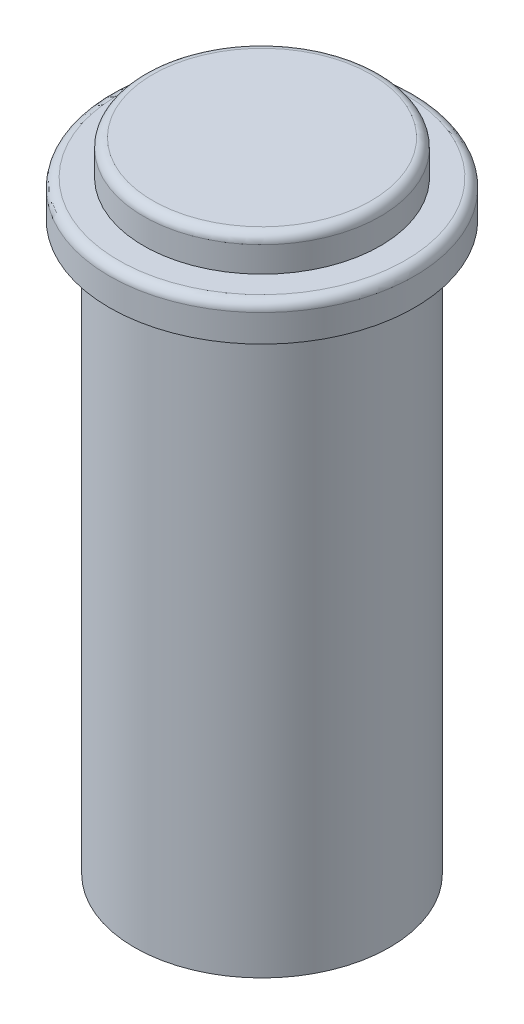
ISO-10303-21;
HEADER;
FILE_DESCRIPTION(('STEP AP214'),'2;1');
FILE_NAME('part.step','',(''),(''),'','','');
FILE_SCHEMA(('AUTOMOTIVE_DESIGN { 1 0 10303 214 1 1 1 1 }'));
ENDSEC;
DATA;
#1=APPLICATION_CONTEXT('core data for automotive mechanical design processes');
#2=APPLICATION_PROTOCOL_DEFINITION('international standard','automotive_design',2000,#1);
#3=PRODUCT_CONTEXT('',#1,'mechanical');
#4=PRODUCT('Part','Part','',(#3));
#5=PRODUCT_RELATED_PRODUCT_CATEGORY('part','',(#4));
#6=PRODUCT_DEFINITION_FORMATION('','',#4);
#7=PRODUCT_DEFINITION_CONTEXT('part definition',#1,'design');
#8=PRODUCT_DEFINITION('design','',#6,#7);
#9=PRODUCT_DEFINITION_SHAPE('','',#8);
#10=(LENGTH_UNIT() NAMED_UNIT(*) SI_UNIT(.MILLI.,.METRE.));
#11=(NAMED_UNIT(*) PLANE_ANGLE_UNIT() SI_UNIT($,.RADIAN.));
#12=(NAMED_UNIT(*) SI_UNIT($,.STERADIAN.) SOLID_ANGLE_UNIT());
#13=UNCERTAINTY_MEASURE_WITH_UNIT(LENGTH_MEASURE(1.E-05),#10,'distance_accuracy_value','');
#14=(GEOMETRIC_REPRESENTATION_CONTEXT(3) GLOBAL_UNCERTAINTY_ASSIGNED_CONTEXT((#13)) GLOBAL_UNIT_ASSIGNED_CONTEXT((#10,
#11,#12)) REPRESENTATION_CONTEXT('',''));
#15=CARTESIAN_POINT('',(0.,0.,0.));
#16=DIRECTION('',(0.,0.,1.));
#17=DIRECTION('',(1.,0.,0.));
#18=AXIS2_PLACEMENT_3D('',#15,#16,#17);
#19=CARTESIAN_POINT('',(0.,0.,0.));
#20=DIRECTION('',(0.,1.,0.));
#21=DIRECTION('',(0.,0.,1.));
#22=AXIS2_PLACEMENT_3D('',#19,#20,#21);
#23=PLANE('',#22);
#24=CARTESIAN_POINT('',(0.,0.,0.));
#25=DIRECTION('',(0.,-1.,0.));
#26=DIRECTION('',(0.,0.,-1.));
#27=AXIS2_PLACEMENT_3D('',#24,#25,#26);
#28=CIRCLE('',#27,14.);
#29=CARTESIAN_POINT('',(0.,0.,-14.));
#30=VERTEX_POINT('',#29);
#31=EDGE_CURVE('E64',#30,#30,#28,.T.);
#32=ORIENTED_EDGE('',*,*,#31,.T.);
#33=EDGE_LOOP('',(#32));
#34=FACE_BOUND('',#33,.T.);
#35=ADVANCED_FACE('F38',(#34),#23,.F.);
#36=CARTESIAN_POINT('',(0.,0.,0.));
#37=DIRECTION('',(0.,-1.,0.));
#38=DIRECTION('',(0.,0.,-1.));
#39=AXIS2_PLACEMENT_3D('',#36,#37,#38);
#40=CYLINDRICAL_SURFACE('',#39,14.);
#41=ORIENTED_EDGE('',*,*,#31,.F.);
#42=EDGE_LOOP('',(#41));
#43=FACE_BOUND('',#42,.T.);
#44=CARTESIAN_POINT('',(9.43689570931383E-13,62.2000000000003,-2.77555756156289E-13));
#45=DIRECTION('',(0.,-1.,0.));
#46=DIRECTION('',(0.,0.,-1.));
#47=AXIS2_PLACEMENT_3D('',#44,#45,#46);
#48=CIRCLE('',#47,14.);
#49=CARTESIAN_POINT('',(9.48741085693428E-13,62.2000000000003,-14.0000000000003));
#50=VERTEX_POINT('',#49);
#51=EDGE_CURVE('E68',#50,#50,#48,.T.);
#52=ORIENTED_EDGE('',*,*,#51,.T.);
#53=EDGE_LOOP('',(#52));
#54=FACE_BOUND('',#53,.T.);
#55=ADVANCED_FACE('F99',(#43,#54),#40,.T.);
#56=CARTESIAN_POINT('',(-13.9999999999998,62.2000000000001,-2.22044604925031E-13));
#57=DIRECTION('',(0.,1.,0.));
#58=DIRECTION('',(0.,0.,1.));
#59=AXIS2_PLACEMENT_3D('',#56,#57,#58);
#60=PLANE('',#59);
#61=ORIENTED_EDGE('',*,*,#51,.F.);
#62=EDGE_LOOP('',(#61));
#63=FACE_BOUND('',#62,.T.);
#64=CARTESIAN_POINT('',(9.43689570931383E-13,62.2000000000003,-2.77555756156289E-13));
#65=DIRECTION('',(0.,-1.,0.));
#66=DIRECTION('',(0.,0.,-1.));
#67=AXIS2_PLACEMENT_3D('',#64,#65,#66);
#68=CIRCLE('',#67,16.75);
#69=CARTESIAN_POINT('',(9.49733347521686E-13,62.2000000000003,-16.7500000000003));
#70=VERTEX_POINT('',#69);
#71=EDGE_CURVE('E72',#70,#70,#68,.T.);
#72=ORIENTED_EDGE('',*,*,#71,.T.);
#73=EDGE_LOOP('',(#72));
#74=FACE_BOUND('',#73,.T.);
#75=ADVANCED_FACE('F105',(#63,#74),#60,.F.);
#76=CARTESIAN_POINT('',(0.,0.,0.));
#77=DIRECTION('',(0.,-1.,0.));
#78=DIRECTION('',(0.,0.,-1.));
#79=AXIS2_PLACEMENT_3D('',#76,#77,#78);
#80=CYLINDRICAL_SURFACE('',#79,16.75);
#81=CARTESIAN_POINT('',(8.88178419700125E-13,65.2000000000001,1.11022302462516E-13));
#82=DIRECTION('',(0.,-1.,0.));
#83=DIRECTION('',(0.,0.,-1.));
#84=AXIS2_PLACEMENT_3D('',#81,#82,#83);
#85=CIRCLE('',#84,16.75);
#86=CARTESIAN_POINT('',(8.94222196290429E-13,65.2000000000001,-16.7499999999999));
#87=VERTEX_POINT('',#86);
#88=EDGE_CURVE('E46',#87,#87,#85,.T.);
#89=ORIENTED_EDGE('',*,*,#88,.T.);
#90=EDGE_LOOP('',(#89));
#91=FACE_BOUND('',#90,.T.);
#92=ORIENTED_EDGE('',*,*,#71,.F.);
#93=EDGE_LOOP('',(#92));
#94=FACE_BOUND('',#93,.T.);
#95=ADVANCED_FACE('F96',(#91,#94),#80,.T.);
#96=CARTESIAN_POINT('',(-16.7499999999997,66.2000000000005,-6.10622663543836E-13));
#97=DIRECTION('',(0.,-1.,0.));
#98=DIRECTION('',(0.,0.,-1.));
#99=AXIS2_PLACEMENT_3D('',#96,#97,#98);
#100=PLANE('',#99);
#101=CARTESIAN_POINT('',(0.,66.2000000000003,-2.77555756156289E-13));
#102=DIRECTION('',(0.,-1.,0.));
#103=DIRECTION('',(0.,0.,-1.));
#104=AXIS2_PLACEMENT_3D('',#101,#102,#103);
#105=CIRCLE('',#104,15.75);
#106=CARTESIAN_POINT('',(0.,66.2000000000003,-15.7500000000003));
#107=VERTEX_POINT('',#106);
#108=EDGE_CURVE('E10',#107,#107,#105,.F.);
#109=ORIENTED_EDGE('',*,*,#108,.T.);
#110=EDGE_LOOP('',(#109));
#111=FACE_BOUND('',#110,.T.);
#112=CARTESIAN_POINT('',(0.,66.2000000000003,-2.77555756156289E-13));
#113=DIRECTION('',(0.,-1.,0.));
#114=DIRECTION('',(0.,0.,-1.));
#115=AXIS2_PLACEMENT_3D('',#112,#113,#114);
#116=CIRCLE('',#115,13.);
#117=CARTESIAN_POINT('',(0.,66.2000000000003,-13.0000000000003));
#118=VERTEX_POINT('',#117);
#119=EDGE_CURVE('E76',#118,#118,#116,.T.);
#120=ORIENTED_EDGE('',*,*,#119,.T.);
#121=EDGE_LOOP('',(#120));
#122=FACE_BOUND('',#121,.T.);
#123=ADVANCED_FACE('F82',(#111,#122),#100,.F.);
#124=CARTESIAN_POINT('',(0.,0.,0.));
#125=DIRECTION('',(0.,-1.,0.));
#126=DIRECTION('',(0.,0.,-1.));
#127=AXIS2_PLACEMENT_3D('',#124,#125,#126);
#128=CYLINDRICAL_SURFACE('',#127,13.);
#129=CARTESIAN_POINT('',(0.,69.,0.));
#130=DIRECTION('',(0.,-1.,0.));
#131=DIRECTION('',(0.,0.,-1.));
#132=AXIS2_PLACEMENT_3D('',#129,#130,#131);
#133=CIRCLE('',#132,13.);
#134=CARTESIAN_POINT('',(0.,69.,-13.));
#135=VERTEX_POINT('',#134);
#136=EDGE_CURVE('E58',#135,#135,#133,.T.);
#137=ORIENTED_EDGE('',*,*,#136,.T.);
#138=EDGE_LOOP('',(#137));
#139=FACE_BOUND('',#138,.T.);
#140=ORIENTED_EDGE('',*,*,#119,.F.);
#141=EDGE_LOOP('',(#140));
#142=FACE_BOUND('',#141,.T.);
#143=ADVANCED_FACE('F84',(#139,#142),#128,.T.);
#144=CARTESIAN_POINT('',(-13.0000000000001,70.0000000000002,-6.10622663543836E-13));
#145=DIRECTION('',(0.,-1.,0.));
#146=DIRECTION('',(0.,0.,-1.));
#147=AXIS2_PLACEMENT_3D('',#144,#145,#146);
#148=PLANE('',#147);
#149=CARTESIAN_POINT('',(0.,70.0000000000002,-3.88578058618805E-13));
#150=DIRECTION('',(0.,-1.,0.));
#151=DIRECTION('',(0.,0.,-1.));
#152=AXIS2_PLACEMENT_3D('',#149,#150,#151);
#153=CIRCLE('',#152,12.);
#154=CARTESIAN_POINT('',(0.,70.0000000000002,-12.0000000000004));
#155=VERTEX_POINT('',#154);
#156=EDGE_CURVE('E52',#155,#155,#153,.F.);
#157=ORIENTED_EDGE('',*,*,#156,.T.);
#158=EDGE_LOOP('',(#157));
#159=FACE_BOUND('',#158,.T.);
#160=ADVANCED_FACE('F86',(#159),#148,.F.);
#161=CARTESIAN_POINT('',(0.,69.,0.));
#162=DIRECTION('',(0.,-1.,0.));
#163=DIRECTION('',(0.,0.,-1.));
#164=AXIS2_PLACEMENT_3D('',#161,#162,#163);
#165=TOROIDAL_SURFACE('',#164,12.,1.);
#166=ORIENTED_EDGE('',*,*,#156,.F.);
#167=EDGE_LOOP('',(#166));
#168=FACE_BOUND('',#167,.T.);
#169=ORIENTED_EDGE('',*,*,#136,.F.);
#170=EDGE_LOOP('',(#169));
#171=FACE_BOUND('',#170,.T.);
#172=ADVANCED_FACE('F93',(#168,#171),#165,.T.);
#173=CARTESIAN_POINT('',(8.88178419700125E-13,65.2000000000001,1.11022302462516E-13));
#174=DIRECTION('',(0.,-1.,0.));
#175=DIRECTION('',(0.,0.,-1.));
#176=AXIS2_PLACEMENT_3D('',#173,#174,#175);
#177=TOROIDAL_SURFACE('',#176,15.75,1.);
#178=ORIENTED_EDGE('',*,*,#108,.F.);
#179=EDGE_LOOP('',(#178));
#180=FACE_BOUND('',#179,.T.);
#181=ORIENTED_EDGE('',*,*,#88,.F.);
#182=EDGE_LOOP('',(#181));
#183=FACE_BOUND('',#182,.T.);
#184=ADVANCED_FACE('F40',(#180,#183),#177,.T.);
#185=CLOSED_SHELL('',(#35,#55,#75,#95,#123,#143,#160,#172,#184));
#186=MANIFOLD_SOLID_BREP('B2',#185);
#187=ADVANCED_BREP_SHAPE_REPRESENTATION('',(#18,#186),#14);
#188=SHAPE_DEFINITION_REPRESENTATION(#9,#187);
ENDSEC;
END-ISO-10303-21;
